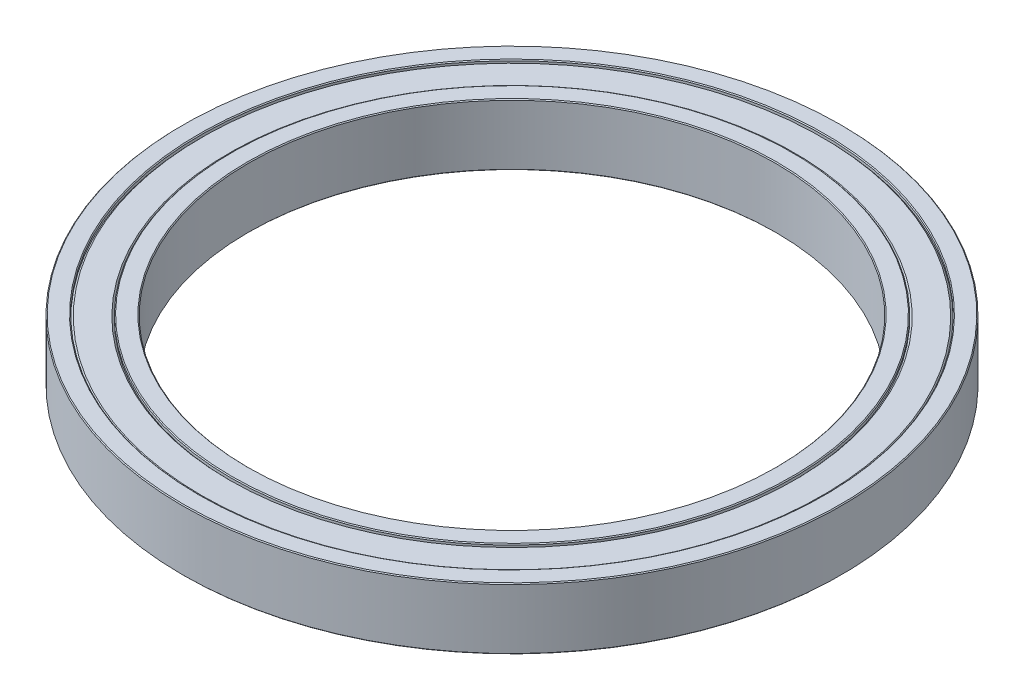
ISO-10303-21;
HEADER;
FILE_DESCRIPTION(('STEP AP214'),'2;1');
FILE_NAME('part.step','',(''),(''),'','','');
FILE_SCHEMA(('AUTOMOTIVE_DESIGN { 1 0 10303 214 1 1 1 1 }'));
ENDSEC;
DATA;
#1=APPLICATION_CONTEXT('core data for automotive mechanical design processes');
#2=APPLICATION_PROTOCOL_DEFINITION('international standard','automotive_design',2000,#1);
#3=PRODUCT_CONTEXT('',#1,'mechanical');
#4=PRODUCT('Part','Part','',(#3));
#5=PRODUCT_RELATED_PRODUCT_CATEGORY('part','',(#4));
#6=PRODUCT_DEFINITION_FORMATION('','',#4);
#7=PRODUCT_DEFINITION_CONTEXT('part definition',#1,'design');
#8=PRODUCT_DEFINITION('design','',#6,#7);
#9=PRODUCT_DEFINITION_SHAPE('','',#8);
#10=(LENGTH_UNIT() NAMED_UNIT(*) SI_UNIT(.MILLI.,.METRE.));
#11=(NAMED_UNIT(*) PLANE_ANGLE_UNIT() SI_UNIT($,.RADIAN.));
#12=(NAMED_UNIT(*) SI_UNIT($,.STERADIAN.) SOLID_ANGLE_UNIT());
#13=UNCERTAINTY_MEASURE_WITH_UNIT(LENGTH_MEASURE(1.E-05),#10,'distance_accuracy_value','');
#14=(GEOMETRIC_REPRESENTATION_CONTEXT(3) GLOBAL_UNCERTAINTY_ASSIGNED_CONTEXT((#13)) GLOBAL_UNIT_ASSIGNED_CONTEXT((#10,
#11,#12)) REPRESENTATION_CONTEXT('',''));
#15=CARTESIAN_POINT('',(0.,0.,0.));
#16=DIRECTION('',(0.,0.,1.));
#17=DIRECTION('',(1.,0.,0.));
#18=AXIS2_PLACEMENT_3D('',#15,#16,#17);
#19=CARTESIAN_POINT('',(0.,-3.5,0.));
#20=DIRECTION('',(0.,1.,0.));
#21=DIRECTION('',(0.,0.,1.));
#22=AXIS2_PLACEMENT_3D('',#19,#20,#21);
#23=PLANE('',#22);
#24=CARTESIAN_POINT('',(0.,-3.5,0.));
#25=DIRECTION('',(0.,1.,0.));
#26=DIRECTION('',(0.,0.,1.));
#27=AXIS2_PLACEMENT_3D('',#24,#25,#26);
#28=CIRCLE('',#27,35.6);
#29=CARTESIAN_POINT('',(0.,-3.50000000000001,35.6));
#30=VERTEX_POINT('',#29);
#31=EDGE_CURVE('E61',#30,#30,#28,.T.);
#32=ORIENTED_EDGE('',*,*,#31,.T.);
#33=EDGE_LOOP('',(#32));
#34=FACE_BOUND('',#33,.T.);
#35=CARTESIAN_POINT('',(0.,-3.5,0.));
#36=DIRECTION('',(0.,1.,0.));
#37=DIRECTION('',(0.,0.,1.));
#38=AXIS2_PLACEMENT_3D('',#35,#36,#37);
#39=CIRCLE('',#38,37.4);
#40=CARTESIAN_POINT('',(0.,-3.50000000000001,37.4));
#41=VERTEX_POINT('',#40);
#42=EDGE_CURVE('E64',#41,#41,#39,.F.);
#43=ORIENTED_EDGE('',*,*,#42,.T.);
#44=EDGE_LOOP('',(#43));
#45=FACE_BOUND('',#44,.T.);
#46=ADVANCED_FACE('F35',(#34,#45),#23,.F.);
#47=CARTESIAN_POINT('',(0.,-3.5,0.));
#48=DIRECTION('',(0.,1.,0.));
#49=DIRECTION('',(0.,0.,1.));
#50=AXIS2_PLACEMENT_3D('',#47,#48,#49);
#51=CIRCLE('',#50,30.1);
#52=CARTESIAN_POINT('',(0.,-3.50000000000001,30.1));
#53=VERTEX_POINT('',#52);
#54=EDGE_CURVE('E85',#53,#53,#51,.T.);
#55=ORIENTED_EDGE('',*,*,#54,.T.);
#56=EDGE_LOOP('',(#55));
#57=FACE_BOUND('',#56,.T.);
#58=CARTESIAN_POINT('',(0.,-3.5,0.));
#59=DIRECTION('',(0.,1.,0.));
#60=DIRECTION('',(0.,0.,1.));
#61=AXIS2_PLACEMENT_3D('',#58,#59,#60);
#62=CIRCLE('',#61,31.9);
#63=CARTESIAN_POINT('',(0.,-3.50000000000001,31.9));
#64=VERTEX_POINT('',#63);
#65=EDGE_CURVE('E88',#64,#64,#62,.F.);
#66=ORIENTED_EDGE('',*,*,#65,.T.);
#67=EDGE_LOOP('',(#66));
#68=FACE_BOUND('',#67,.T.);
#69=ADVANCED_FACE('F142',(#57,#68),#23,.F.);
#70=CARTESIAN_POINT('',(0.,3.49999999999999,0.));
#71=DIRECTION('',(0.,1.,0.));
#72=DIRECTION('',(0.,0.,1.));
#73=AXIS2_PLACEMENT_3D('',#70,#71,#72);
#74=PLANE('',#73);
#75=CARTESIAN_POINT('',(0.,3.49999999999999,0.));
#76=DIRECTION('',(0.,1.,0.));
#77=DIRECTION('',(0.,0.,1.));
#78=AXIS2_PLACEMENT_3D('',#75,#76,#77);
#79=CIRCLE('',#78,35.5999999999999);
#80=CARTESIAN_POINT('',(0.,3.49999999999999,35.5999999999999));
#81=VERTEX_POINT('',#80);
#82=EDGE_CURVE('E46',#81,#81,#79,.F.);
#83=ORIENTED_EDGE('',*,*,#82,.T.);
#84=EDGE_LOOP('',(#83));
#85=FACE_BOUND('',#84,.T.);
#86=CARTESIAN_POINT('',(0.,3.49999999999999,0.));
#87=DIRECTION('',(0.,1.,0.));
#88=DIRECTION('',(0.,0.,1.));
#89=AXIS2_PLACEMENT_3D('',#86,#87,#88);
#90=CIRCLE('',#89,37.4);
#91=CARTESIAN_POINT('',(0.,3.49999999999999,37.4));
#92=VERTEX_POINT('',#91);
#93=EDGE_CURVE('E50',#92,#92,#90,.T.);
#94=ORIENTED_EDGE('',*,*,#93,.T.);
#95=EDGE_LOOP('',(#94));
#96=FACE_BOUND('',#95,.T.);
#97=ADVANCED_FACE('F148',(#85,#96),#74,.T.);
#98=CARTESIAN_POINT('',(0.,3.49999999999999,0.));
#99=DIRECTION('',(0.,1.,0.));
#100=DIRECTION('',(0.,0.,1.));
#101=AXIS2_PLACEMENT_3D('',#98,#99,#100);
#102=CIRCLE('',#101,30.1);
#103=CARTESIAN_POINT('',(0.,3.49999999999999,30.1));
#104=VERTEX_POINT('',#103);
#105=EDGE_CURVE('E73',#104,#104,#102,.F.);
#106=ORIENTED_EDGE('',*,*,#105,.T.);
#107=EDGE_LOOP('',(#106));
#108=FACE_BOUND('',#107,.T.);
#109=CARTESIAN_POINT('',(0.,3.49999999999999,0.));
#110=DIRECTION('',(0.,1.,0.));
#111=DIRECTION('',(0.,0.,1.));
#112=AXIS2_PLACEMENT_3D('',#109,#110,#111);
#113=CIRCLE('',#112,31.9);
#114=CARTESIAN_POINT('',(0.,3.49999999999999,31.9));
#115=VERTEX_POINT('',#114);
#116=EDGE_CURVE('E76',#115,#115,#113,.T.);
#117=ORIENTED_EDGE('',*,*,#116,.T.);
#118=EDGE_LOOP('',(#117));
#119=FACE_BOUND('',#118,.T.);
#120=ADVANCED_FACE('F158',(#108,#119),#74,.T.);
#121=CARTESIAN_POINT('',(0.,3.49999999999999,0.));
#122=DIRECTION('',(0.,1.,0.));
#123=DIRECTION('',(0.,0.,1.));
#124=AXIS2_PLACEMENT_3D('',#121,#122,#123);
#125=CYLINDRICAL_SURFACE('',#124,30.);
#126=CARTESIAN_POINT('',(0.,-3.39999999999999,0.));
#127=DIRECTION('',(0.,1.,0.));
#128=DIRECTION('',(0.,0.,1.));
#129=AXIS2_PLACEMENT_3D('',#126,#127,#128);
#130=CIRCLE('',#129,30.);
#131=CARTESIAN_POINT('',(0.,-3.4,30.));
#132=VERTEX_POINT('',#131);
#133=EDGE_CURVE('E79',#132,#132,#130,.F.);
#134=ORIENTED_EDGE('',*,*,#133,.T.);
#135=EDGE_LOOP('',(#134));
#136=FACE_BOUND('',#135,.T.);
#137=CARTESIAN_POINT('',(0.,3.40000000000002,0.));
#138=DIRECTION('',(0.,1.,0.));
#139=DIRECTION('',(0.,0.,1.));
#140=AXIS2_PLACEMENT_3D('',#137,#138,#139);
#141=CIRCLE('',#140,30.);
#142=CARTESIAN_POINT('',(0.,3.40000000000002,30.));
#143=VERTEX_POINT('',#142);
#144=EDGE_CURVE('E82',#143,#143,#141,.T.);
#145=ORIENTED_EDGE('',*,*,#144,.T.);
#146=EDGE_LOOP('',(#145));
#147=FACE_BOUND('',#146,.T.);
#148=ADVANCED_FACE('F155',(#136,#147),#125,.F.);
#149=CARTESIAN_POINT('',(0.,3.49999999999999,0.));
#150=DIRECTION('',(0.,1.,0.));
#151=DIRECTION('',(0.,0.,1.));
#152=AXIS2_PLACEMENT_3D('',#149,#150,#151);
#153=CYLINDRICAL_SURFACE('',#152,37.5);
#154=CARTESIAN_POINT('',(0.,-3.40000000000002,0.));
#155=DIRECTION('',(0.,1.,0.));
#156=DIRECTION('',(0.,0.,1.));
#157=AXIS2_PLACEMENT_3D('',#154,#155,#156);
#158=CIRCLE('',#157,37.5);
#159=CARTESIAN_POINT('',(0.,-3.40000000000003,37.5));
#160=VERTEX_POINT('',#159);
#161=EDGE_CURVE('E10',#160,#160,#158,.T.);
#162=ORIENTED_EDGE('',*,*,#161,.T.);
#163=EDGE_LOOP('',(#162));
#164=FACE_BOUND('',#163,.T.);
#165=CARTESIAN_POINT('',(0.,3.39999999999998,0.));
#166=DIRECTION('',(0.,1.,0.));
#167=DIRECTION('',(0.,0.,1.));
#168=AXIS2_PLACEMENT_3D('',#165,#166,#167);
#169=CIRCLE('',#168,37.5);
#170=CARTESIAN_POINT('',(0.,3.39999999999998,37.5));
#171=VERTEX_POINT('',#170);
#172=EDGE_CURVE('E42',#171,#171,#169,.F.);
#173=ORIENTED_EDGE('',*,*,#172,.T.);
#174=EDGE_LOOP('',(#173));
#175=FACE_BOUND('',#174,.T.);
#176=ADVANCED_FACE('F153',(#164,#175),#153,.T.);
#177=CARTESIAN_POINT('',(0.,3.29999999999999,0.));
#178=DIRECTION('',(0.,-1.,0.));
#179=DIRECTION('',(0.,0.,-1.));
#180=AXIS2_PLACEMENT_3D('',#177,#178,#179);
#181=CONICAL_SURFACE('',#180,35.3,0.785398163397431);
#182=CARTESIAN_POINT('',(0.,3.1,0.));
#183=DIRECTION('',(0.,1.,0.));
#184=DIRECTION('',(0.,0.,1.));
#185=AXIS2_PLACEMENT_3D('',#182,#183,#184);
#186=CIRCLE('',#185,35.5);
#187=CARTESIAN_POINT('',(0.,3.09999999999999,35.5));
#188=VERTEX_POINT('',#187);
#189=EDGE_CURVE('E91',#188,#188,#186,.T.);
#190=ORIENTED_EDGE('',*,*,#189,.T.);
#191=EDGE_LOOP('',(#190));
#192=FACE_BOUND('',#191,.T.);
#193=CARTESIAN_POINT('',(0.,3.29999999999999,0.));
#194=DIRECTION('',(0.,1.,0.));
#195=DIRECTION('',(0.,0.,1.));
#196=AXIS2_PLACEMENT_3D('',#193,#194,#195);
#197=CIRCLE('',#196,35.3);
#198=CARTESIAN_POINT('',(0.,3.29999999999999,35.3));
#199=VERTEX_POINT('',#198);
#200=EDGE_CURVE('E100',#199,#199,#197,.T.);
#201=ORIENTED_EDGE('',*,*,#200,.F.);
#202=EDGE_LOOP('',(#201));
#203=FACE_BOUND('',#202,.T.);
#204=ADVANCED_FACE('F276',(#192,#203),#181,.T.);
#205=CARTESIAN_POINT('',(0.,3.49999999999999,0.));
#206=DIRECTION('',(0.,1.,0.));
#207=DIRECTION('',(0.,0.,1.));
#208=AXIS2_PLACEMENT_3D('',#205,#206,#207);
#209=CYLINDRICAL_SURFACE('',#208,35.5);
#210=CARTESIAN_POINT('',(0.,3.40000000000005,0.));
#211=DIRECTION('',(0.,1.,0.));
#212=DIRECTION('',(0.,0.,1.));
#213=AXIS2_PLACEMENT_3D('',#210,#211,#212);
#214=CIRCLE('',#213,35.5);
#215=CARTESIAN_POINT('',(0.,3.40000000000005,35.5));
#216=VERTEX_POINT('',#215);
#217=EDGE_CURVE('E55',#216,#216,#214,.T.);
#218=ORIENTED_EDGE('',*,*,#217,.T.);
#219=EDGE_LOOP('',(#218));
#220=FACE_BOUND('',#219,.T.);
#221=ORIENTED_EDGE('',*,*,#189,.F.);
#222=EDGE_LOOP('',(#221));
#223=FACE_BOUND('',#222,.T.);
#224=ADVANCED_FACE('F264',(#220,#223),#209,.F.);
#225=CARTESIAN_POINT('',(0.,3.49999999999999,0.));
#226=DIRECTION('',(0.,1.,0.));
#227=DIRECTION('',(0.,0.,1.));
#228=AXIS2_PLACEMENT_3D('',#225,#226,#227);
#229=CYLINDRICAL_SURFACE('',#228,32.);
#230=CARTESIAN_POINT('',(0.,3.4,0.));
#231=DIRECTION('',(0.,1.,0.));
#232=DIRECTION('',(0.,0.,1.));
#233=AXIS2_PLACEMENT_3D('',#230,#231,#232);
#234=CIRCLE('',#233,32.);
#235=CARTESIAN_POINT('',(0.,3.39999999999999,32.));
#236=VERTEX_POINT('',#235);
#237=EDGE_CURVE('E67',#236,#236,#234,.F.);
#238=ORIENTED_EDGE('',*,*,#237,.T.);
#239=EDGE_LOOP('',(#238));
#240=FACE_BOUND('',#239,.T.);
#241=CARTESIAN_POINT('',(0.,3.1,0.));
#242=DIRECTION('',(0.,1.,0.));
#243=DIRECTION('',(0.,0.,1.));
#244=AXIS2_PLACEMENT_3D('',#241,#242,#243);
#245=CIRCLE('',#244,32.);
#246=CARTESIAN_POINT('',(0.,3.09999999999999,32.));
#247=VERTEX_POINT('',#246);
#248=EDGE_CURVE('E94',#247,#247,#245,.T.);
#249=ORIENTED_EDGE('',*,*,#248,.T.);
#250=EDGE_LOOP('',(#249));
#251=FACE_BOUND('',#250,.T.);
#252=ADVANCED_FACE('F258',(#240,#251),#229,.T.);
#253=CARTESIAN_POINT('',(0.,3.1,0.));
#254=DIRECTION('',(0.,1.,0.));
#255=DIRECTION('',(0.,0.,1.));
#256=AXIS2_PLACEMENT_3D('',#253,#254,#255);
#257=CONICAL_SURFACE('',#256,32.,0.785398163397446);
#258=CARTESIAN_POINT('',(0.,3.29999999999999,0.));
#259=DIRECTION('',(0.,1.,0.));
#260=DIRECTION('',(0.,0.,1.));
#261=AXIS2_PLACEMENT_3D('',#258,#259,#260);
#262=CIRCLE('',#261,32.2);
#263=CARTESIAN_POINT('',(0.,3.29999999999999,32.2));
#264=VERTEX_POINT('',#263);
#265=EDGE_CURVE('E97',#264,#264,#262,.T.);
#266=ORIENTED_EDGE('',*,*,#265,.T.);
#267=EDGE_LOOP('',(#266));
#268=FACE_BOUND('',#267,.T.);
#269=ORIENTED_EDGE('',*,*,#248,.F.);
#270=EDGE_LOOP('',(#269));
#271=FACE_BOUND('',#270,.T.);
#272=ADVANCED_FACE('F263',(#268,#271),#257,.F.);
#273=CARTESIAN_POINT('',(0.,3.29999999999999,0.));
#274=DIRECTION('',(0.,1.,0.));
#275=DIRECTION('',(0.,0.,1.));
#276=AXIS2_PLACEMENT_3D('',#273,#274,#275);
#277=PLANE('',#276);
#278=ORIENTED_EDGE('',*,*,#200,.T.);
#279=EDGE_LOOP('',(#278));
#280=FACE_BOUND('',#279,.T.);
#281=ORIENTED_EDGE('',*,*,#265,.F.);
#282=EDGE_LOOP('',(#281));
#283=FACE_BOUND('',#282,.T.);
#284=ADVANCED_FACE('F339',(#280,#283),#277,.T.);
#285=CARTESIAN_POINT('',(0.,-3.29999999999999,0.));
#286=DIRECTION('',(0.,1.,0.));
#287=DIRECTION('',(0.,0.,-1.));
#288=AXIS2_PLACEMENT_3D('',#285,#286,#287);
#289=CONICAL_SURFACE('',#288,35.3,0.785398163397431);
#290=CARTESIAN_POINT('',(0.,-3.1,0.));
#291=DIRECTION('',(0.,1.,0.));
#292=DIRECTION('',(0.,0.,1.));
#293=AXIS2_PLACEMENT_3D('',#290,#291,#292);
#294=CIRCLE('',#293,35.5);
#295=CARTESIAN_POINT('',(0.,-3.09999999999999,35.5));
#296=VERTEX_POINT('',#295);
#297=EDGE_CURVE('E103',#296,#296,#294,.T.);
#298=ORIENTED_EDGE('',*,*,#297,.F.);
#299=EDGE_LOOP('',(#298));
#300=FACE_BOUND('',#299,.T.);
#301=CARTESIAN_POINT('',(0.,-3.29999999999999,0.));
#302=DIRECTION('',(0.,1.,0.));
#303=DIRECTION('',(0.,0.,1.));
#304=AXIS2_PLACEMENT_3D('',#301,#302,#303);
#305=CIRCLE('',#304,35.3);
#306=CARTESIAN_POINT('',(0.,-3.29999999999999,35.3));
#307=VERTEX_POINT('',#306);
#308=EDGE_CURVE('E112',#307,#307,#305,.T.);
#309=ORIENTED_EDGE('',*,*,#308,.T.);
#310=EDGE_LOOP('',(#309));
#311=FACE_BOUND('',#310,.T.);
#312=ADVANCED_FACE('F116',(#300,#311),#289,.T.);
#313=CARTESIAN_POINT('',(0.,-3.49999999999999,0.));
#314=DIRECTION('',(0.,-1.,0.));
#315=DIRECTION('',(0.,0.,1.));
#316=AXIS2_PLACEMENT_3D('',#313,#314,#315);
#317=CYLINDRICAL_SURFACE('',#316,35.5);
#318=CARTESIAN_POINT('',(0.,-3.39999999999998,0.));
#319=DIRECTION('',(0.,1.,0.));
#320=DIRECTION('',(0.,0.,1.));
#321=AXIS2_PLACEMENT_3D('',#318,#319,#320);
#322=CIRCLE('',#321,35.5);
#323=CARTESIAN_POINT('',(0.,-3.39999999999997,35.5));
#324=VERTEX_POINT('',#323);
#325=EDGE_CURVE('E58',#324,#324,#322,.F.);
#326=ORIENTED_EDGE('',*,*,#325,.T.);
#327=EDGE_LOOP('',(#326));
#328=FACE_BOUND('',#327,.T.);
#329=ORIENTED_EDGE('',*,*,#297,.T.);
#330=EDGE_LOOP('',(#329));
#331=FACE_BOUND('',#330,.T.);
#332=ADVANCED_FACE('F133',(#328,#331),#317,.F.);
#333=CARTESIAN_POINT('',(0.,-3.49999999999999,0.));
#334=DIRECTION('',(0.,-1.,0.));
#335=DIRECTION('',(0.,0.,1.));
#336=AXIS2_PLACEMENT_3D('',#333,#334,#335);
#337=CYLINDRICAL_SURFACE('',#336,32.);
#338=CARTESIAN_POINT('',(0.,-3.39999999999999,0.));
#339=DIRECTION('',(0.,1.,0.));
#340=DIRECTION('',(0.,0.,1.));
#341=AXIS2_PLACEMENT_3D('',#338,#339,#340);
#342=CIRCLE('',#341,32.);
#343=CARTESIAN_POINT('',(0.,-3.39999999999998,32.));
#344=VERTEX_POINT('',#343);
#345=EDGE_CURVE('E70',#344,#344,#342,.T.);
#346=ORIENTED_EDGE('',*,*,#345,.T.);
#347=EDGE_LOOP('',(#346));
#348=FACE_BOUND('',#347,.T.);
#349=CARTESIAN_POINT('',(0.,-3.1,0.));
#350=DIRECTION('',(0.,1.,0.));
#351=DIRECTION('',(0.,0.,1.));
#352=AXIS2_PLACEMENT_3D('',#349,#350,#351);
#353=CIRCLE('',#352,32.);
#354=CARTESIAN_POINT('',(0.,-3.09999999999999,32.));
#355=VERTEX_POINT('',#354);
#356=EDGE_CURVE('E106',#355,#355,#353,.T.);
#357=ORIENTED_EDGE('',*,*,#356,.F.);
#358=EDGE_LOOP('',(#357));
#359=FACE_BOUND('',#358,.T.);
#360=ADVANCED_FACE('F128',(#348,#359),#337,.T.);
#361=CARTESIAN_POINT('',(0.,-3.1,0.));
#362=DIRECTION('',(0.,-1.,0.));
#363=DIRECTION('',(0.,0.,1.));
#364=AXIS2_PLACEMENT_3D('',#361,#362,#363);
#365=CONICAL_SURFACE('',#364,32.,0.785398163397446);
#366=CARTESIAN_POINT('',(0.,-3.29999999999999,0.));
#367=DIRECTION('',(0.,1.,0.));
#368=DIRECTION('',(0.,0.,1.));
#369=AXIS2_PLACEMENT_3D('',#366,#367,#368);
#370=CIRCLE('',#369,32.2);
#371=CARTESIAN_POINT('',(0.,-3.29999999999999,32.2));
#372=VERTEX_POINT('',#371);
#373=EDGE_CURVE('E109',#372,#372,#370,.T.);
#374=ORIENTED_EDGE('',*,*,#373,.F.);
#375=EDGE_LOOP('',(#374));
#376=FACE_BOUND('',#375,.T.);
#377=ORIENTED_EDGE('',*,*,#356,.T.);
#378=EDGE_LOOP('',(#377));
#379=FACE_BOUND('',#378,.T.);
#380=ADVANCED_FACE('F122',(#376,#379),#365,.F.);
#381=CARTESIAN_POINT('',(0.,-3.29999999999999,0.));
#382=DIRECTION('',(0.,-1.,0.));
#383=DIRECTION('',(0.,0.,1.));
#384=AXIS2_PLACEMENT_3D('',#381,#382,#383);
#385=PLANE('',#384);
#386=ORIENTED_EDGE('',*,*,#308,.F.);
#387=EDGE_LOOP('',(#386));
#388=FACE_BOUND('',#387,.T.);
#389=ORIENTED_EDGE('',*,*,#373,.T.);
#390=EDGE_LOOP('',(#389));
#391=FACE_BOUND('',#390,.T.);
#392=ADVANCED_FACE('F118',(#388,#391),#385,.T.);
#393=CARTESIAN_POINT('',(0.,-3.5,0.));
#394=DIRECTION('',(0.,-1.,0.));
#395=DIRECTION('',(0.,0.,-1.));
#396=AXIS2_PLACEMENT_3D('',#393,#394,#395);
#397=CONICAL_SURFACE('',#396,30.1,0.785398163397448);
#398=ORIENTED_EDGE('',*,*,#133,.F.);
#399=EDGE_LOOP('',(#398));
#400=FACE_BOUND('',#399,.T.);
#401=ORIENTED_EDGE('',*,*,#54,.F.);
#402=EDGE_LOOP('',(#401));
#403=FACE_BOUND('',#402,.T.);
#404=ADVANCED_FACE('F121',(#400,#403),#397,.F.);
#405=CARTESIAN_POINT('',(0.,3.40000000000002,0.));
#406=DIRECTION('',(0.,1.,0.));
#407=DIRECTION('',(0.,0.,1.));
#408=AXIS2_PLACEMENT_3D('',#405,#406,#407);
#409=CONICAL_SURFACE('',#408,30.,0.785398163397414);
#410=ORIENTED_EDGE('',*,*,#105,.F.);
#411=EDGE_LOOP('',(#410));
#412=FACE_BOUND('',#411,.T.);
#413=ORIENTED_EDGE('',*,*,#144,.F.);
#414=EDGE_LOOP('',(#413));
#415=FACE_BOUND('',#414,.T.);
#416=ADVANCED_FACE('F165',(#412,#415),#409,.F.);
#417=CARTESIAN_POINT('',(0.,-3.39999999999999,0.));
#418=DIRECTION('',(0.,1.,0.));
#419=DIRECTION('',(0.,0.,1.));
#420=AXIS2_PLACEMENT_3D('',#417,#418,#419);
#421=CONICAL_SURFACE('',#420,32.,0.785398163397448);
#422=ORIENTED_EDGE('',*,*,#65,.F.);
#423=EDGE_LOOP('',(#422));
#424=FACE_BOUND('',#423,.T.);
#425=ORIENTED_EDGE('',*,*,#345,.F.);
#426=EDGE_LOOP('',(#425));
#427=FACE_BOUND('',#426,.T.);
#428=ADVANCED_FACE('F169',(#424,#427),#421,.T.);
#429=CARTESIAN_POINT('',(0.,3.49999999999999,0.));
#430=DIRECTION('',(0.,-1.,0.));
#431=DIRECTION('',(0.,0.,-1.));
#432=AXIS2_PLACEMENT_3D('',#429,#430,#431);
#433=CONICAL_SURFACE('',#432,31.9,0.785398163397518);
#434=ORIENTED_EDGE('',*,*,#237,.F.);
#435=EDGE_LOOP('',(#434));
#436=FACE_BOUND('',#435,.T.);
#437=ORIENTED_EDGE('',*,*,#116,.F.);
#438=EDGE_LOOP('',(#437));
#439=FACE_BOUND('',#438,.T.);
#440=ADVANCED_FACE('F173',(#436,#439),#433,.T.);
#441=CARTESIAN_POINT('',(0.,-3.5,0.));
#442=DIRECTION('',(0.,-1.,0.));
#443=DIRECTION('',(0.,0.,-1.));
#444=AXIS2_PLACEMENT_3D('',#441,#442,#443);
#445=CONICAL_SURFACE('',#444,35.6,0.785398163397483);
#446=ORIENTED_EDGE('',*,*,#325,.F.);
#447=EDGE_LOOP('',(#446));
#448=FACE_BOUND('',#447,.T.);
#449=ORIENTED_EDGE('',*,*,#31,.F.);
#450=EDGE_LOOP('',(#449));
#451=FACE_BOUND('',#450,.T.);
#452=ADVANCED_FACE('F177',(#448,#451),#445,.F.);
#453=CARTESIAN_POINT('',(0.,3.40000000000005,0.));
#454=DIRECTION('',(0.,1.,0.));
#455=DIRECTION('',(0.,0.,1.));
#456=AXIS2_PLACEMENT_3D('',#453,#454,#455);
#457=CONICAL_SURFACE('',#456,35.5,0.785398163397483);
#458=ORIENTED_EDGE('',*,*,#82,.F.);
#459=EDGE_LOOP('',(#458));
#460=FACE_BOUND('',#459,.T.);
#461=ORIENTED_EDGE('',*,*,#217,.F.);
#462=EDGE_LOOP('',(#461));
#463=FACE_BOUND('',#462,.T.);
#464=ADVANCED_FACE('F181',(#460,#463),#457,.F.);
#465=CARTESIAN_POINT('',(0.,-3.40000000000002,0.));
#466=DIRECTION('',(0.,1.,0.));
#467=DIRECTION('',(0.,0.,1.));
#468=AXIS2_PLACEMENT_3D('',#465,#466,#467);
#469=CONICAL_SURFACE('',#468,37.5,0.785398163397414);
#470=ORIENTED_EDGE('',*,*,#42,.F.);
#471=EDGE_LOOP('',(#470));
#472=FACE_BOUND('',#471,.T.);
#473=ORIENTED_EDGE('',*,*,#161,.F.);
#474=EDGE_LOOP('',(#473));
#475=FACE_BOUND('',#474,.T.);
#476=ADVANCED_FACE('F184',(#472,#475),#469,.T.);
#477=CARTESIAN_POINT('',(0.,3.49999999999999,0.));
#478=DIRECTION('',(0.,-1.,0.));
#479=DIRECTION('',(0.,0.,-1.));
#480=AXIS2_PLACEMENT_3D('',#477,#478,#479);
#481=CONICAL_SURFACE('',#480,37.4,0.785398163397483);
#482=ORIENTED_EDGE('',*,*,#172,.F.);
#483=EDGE_LOOP('',(#482));
#484=FACE_BOUND('',#483,.T.);
#485=ORIENTED_EDGE('',*,*,#93,.F.);
#486=EDGE_LOOP('',(#485));
#487=FACE_BOUND('',#486,.T.);
#488=ADVANCED_FACE('F37',(#484,#487),#481,.T.);
#489=CLOSED_SHELL('',(#46,#69,#97,#120,#148,#176,#204,#224,#252,#272,#284,#312,#332,#360,#380,
#392,#404,#416,#428,#440,#452,#464,#476,#488));
#490=MANIFOLD_SOLID_BREP('B2',#489);
#491=ADVANCED_BREP_SHAPE_REPRESENTATION('',(#18,#490),#14);
#492=SHAPE_DEFINITION_REPRESENTATION(#9,#491);
ENDSEC;
END-ISO-10303-21;
